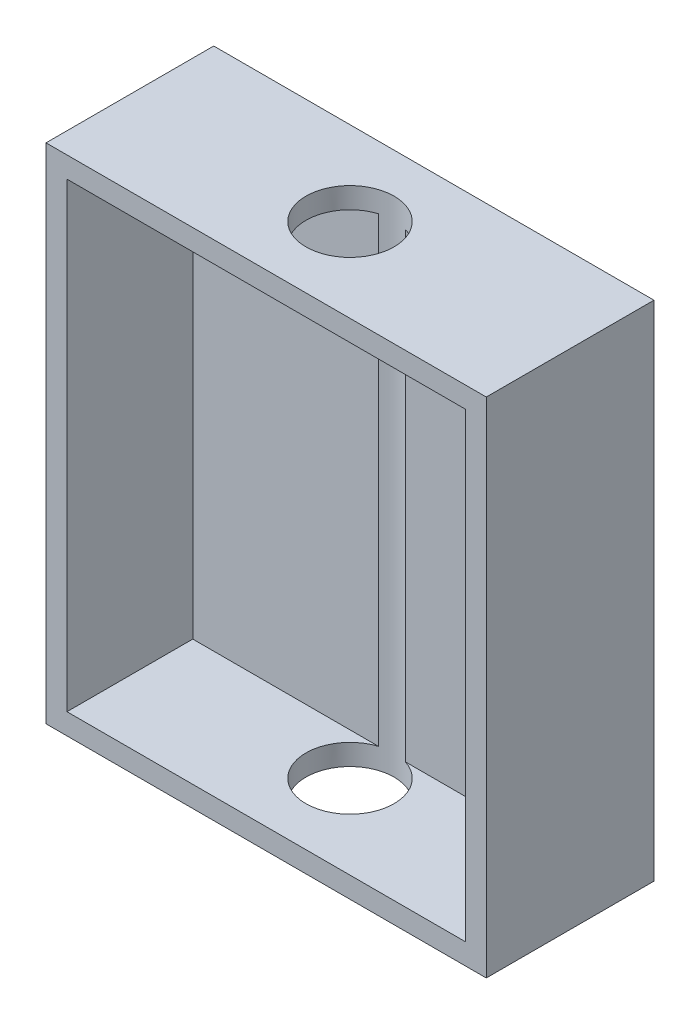
ISO-10303-21;
HEADER;
FILE_DESCRIPTION(('STEP AP214'),'2;1');
FILE_NAME('part.step','',(''),(''),'','','');
FILE_SCHEMA(('AUTOMOTIVE_DESIGN { 1 0 10303 214 1 1 1 1 }'));
ENDSEC;
DATA;
#1=APPLICATION_CONTEXT('core data for automotive mechanical design processes');
#2=APPLICATION_PROTOCOL_DEFINITION('international standard','automotive_design',2000,#1);
#3=PRODUCT_CONTEXT('',#1,'mechanical');
#4=PRODUCT('Part','Part','',(#3));
#5=PRODUCT_RELATED_PRODUCT_CATEGORY('part','',(#4));
#6=PRODUCT_DEFINITION_FORMATION('','',#4);
#7=PRODUCT_DEFINITION_CONTEXT('part definition',#1,'design');
#8=PRODUCT_DEFINITION('design','',#6,#7);
#9=PRODUCT_DEFINITION_SHAPE('','',#8);
#10=(LENGTH_UNIT() NAMED_UNIT(*) SI_UNIT(.MILLI.,.METRE.));
#11=(NAMED_UNIT(*) PLANE_ANGLE_UNIT() SI_UNIT($,.RADIAN.));
#12=(NAMED_UNIT(*) SI_UNIT($,.STERADIAN.) SOLID_ANGLE_UNIT());
#13=UNCERTAINTY_MEASURE_WITH_UNIT(LENGTH_MEASURE(1.E-05),#10,'distance_accuracy_value','');
#14=(GEOMETRIC_REPRESENTATION_CONTEXT(3) GLOBAL_UNCERTAINTY_ASSIGNED_CONTEXT((#13)) GLOBAL_UNIT_ASSIGNED_CONTEXT((#10,
#11,#12)) REPRESENTATION_CONTEXT('',''));
#15=CARTESIAN_POINT('',(0.,0.,0.));
#16=DIRECTION('',(0.,0.,1.));
#17=DIRECTION('',(1.,0.,0.));
#18=AXIS2_PLACEMENT_3D('',#15,#16,#17);
#19=CARTESIAN_POINT('',(0.,0.,2.));
#20=DIRECTION('',(0.,0.,1.));
#21=DIRECTION('',(1.,0.,0.));
#22=AXIS2_PLACEMENT_3D('',#19,#20,#21);
#23=PLANE('',#22);
#24=DIRECTION('',(0.,-1.,0.));
#25=VECTOR('',#24,1.);
#26=CARTESIAN_POINT('',(-0.640312423743285,18.,2.));
#27=LINE('',#26,#25);
#28=CARTESIAN_POINT('',(-0.640312423743285,11.,2.));
#29=VERTEX_POINT('',#28);
#30=CARTESIAN_POINT('',(-0.640312423743285,-11.,2.));
#31=VERTEX_POINT('',#30);
#32=EDGE_CURVE('E11',#29,#31,#27,.T.);
#33=ORIENTED_EDGE('',*,*,#32,.F.);
#34=DIRECTION('',(1.,0.,0.));
#35=VECTOR('',#34,1.);
#36=CARTESIAN_POINT('',(9.5,11.,2.));
#37=LINE('',#36,#35);
#38=CARTESIAN_POINT('',(-9.5,11.,2.));
#39=VERTEX_POINT('',#38);
#40=EDGE_CURVE('E123',#39,#29,#37,.T.);
#41=ORIENTED_EDGE('',*,*,#40,.F.);
#42=DIRECTION('',(0.,1.,0.));
#43=VECTOR('',#42,1.);
#44=CARTESIAN_POINT('',(-9.5,-11.,2.));
#45=LINE('',#44,#43);
#46=CARTESIAN_POINT('',(-9.5,-11.,2.));
#47=VERTEX_POINT('',#46);
#48=EDGE_CURVE('E130',#47,#39,#45,.T.);
#49=ORIENTED_EDGE('',*,*,#48,.F.);
#50=DIRECTION('',(-1.,0.,0.));
#51=VECTOR('',#50,1.);
#52=CARTESIAN_POINT('',(9.5,-11.,2.));
#53=LINE('',#52,#51);
#54=EDGE_CURVE('E136',#31,#47,#53,.T.);
#55=ORIENTED_EDGE('',*,*,#54,.F.);
#56=EDGE_LOOP('',(#33,#41,#49,#55));
#57=FACE_BOUND('',#56,.T.);
#58=ADVANCED_FACE('F36',(#57),#23,.T.);
#59=CARTESIAN_POINT('',(0.,0.,8.));
#60=DIRECTION('',(0.,0.,-1.));
#61=DIRECTION('',(-1.,0.,0.));
#62=AXIS2_PLACEMENT_3D('',#59,#60,#61);
#63=PLANE('',#62);
#64=DIRECTION('',(0.,1.,0.));
#65=VECTOR('',#64,1.);
#66=CARTESIAN_POINT('',(10.5,-12.,8.));
#67=LINE('',#66,#65);
#68=CARTESIAN_POINT('',(10.5,-12.,8.));
#69=VERTEX_POINT('',#68);
#70=CARTESIAN_POINT('',(10.5,12.,8.));
#71=VERTEX_POINT('',#70);
#72=EDGE_CURVE('E158',#69,#71,#67,.T.);
#73=ORIENTED_EDGE('',*,*,#72,.T.);
#74=DIRECTION('',(-1.,0.,0.));
#75=VECTOR('',#74,1.);
#76=CARTESIAN_POINT('',(-10.5,12.,8.));
#77=LINE('',#76,#75);
#78=CARTESIAN_POINT('',(-10.5,12.,8.));
#79=VERTEX_POINT('',#78);
#80=EDGE_CURVE('E161',#71,#79,#77,.T.);
#81=ORIENTED_EDGE('',*,*,#80,.T.);
#82=DIRECTION('',(0.,-1.,0.));
#83=VECTOR('',#82,1.);
#84=CARTESIAN_POINT('',(-10.5,-12.,8.));
#85=LINE('',#84,#83);
#86=CARTESIAN_POINT('',(-10.5,-12.,8.));
#87=VERTEX_POINT('',#86);
#88=EDGE_CURVE('E164',#79,#87,#85,.T.);
#89=ORIENTED_EDGE('',*,*,#88,.T.);
#90=DIRECTION('',(1.,0.,0.));
#91=VECTOR('',#90,1.);
#92=CARTESIAN_POINT('',(-10.5,-12.,8.));
#93=LINE('',#92,#91);
#94=EDGE_CURVE('E166',#87,#69,#93,.T.);
#95=ORIENTED_EDGE('',*,*,#94,.T.);
#96=EDGE_LOOP('',(#73,#81,#89,#95));
#97=FACE_BOUND('',#96,.T.);
#98=DIRECTION('',(0.,1.,0.));
#99=VECTOR('',#98,1.);
#100=CARTESIAN_POINT('',(9.5,-11.,8.));
#101=LINE('',#100,#99);
#102=CARTESIAN_POINT('',(9.5,-11.,8.));
#103=VERTEX_POINT('',#102);
#104=CARTESIAN_POINT('',(9.5,11.,8.));
#105=VERTEX_POINT('',#104);
#106=EDGE_CURVE('E139',#103,#105,#101,.T.);
#107=ORIENTED_EDGE('',*,*,#106,.F.);
#108=DIRECTION('',(1.,0.,0.));
#109=VECTOR('',#108,1.);
#110=CARTESIAN_POINT('',(-9.5,-11.,8.));
#111=LINE('',#110,#109);
#112=CARTESIAN_POINT('',(-9.5,-11.,8.));
#113=VERTEX_POINT('',#112);
#114=EDGE_CURVE('E146',#113,#103,#111,.T.);
#115=ORIENTED_EDGE('',*,*,#114,.F.);
#116=DIRECTION('',(0.,-1.,0.));
#117=VECTOR('',#116,1.);
#118=CARTESIAN_POINT('',(-9.5,-11.,8.));
#119=LINE('',#118,#117);
#120=CARTESIAN_POINT('',(-9.5,11.,8.));
#121=VERTEX_POINT('',#120);
#122=EDGE_CURVE('E143',#121,#113,#119,.T.);
#123=ORIENTED_EDGE('',*,*,#122,.F.);
#124=DIRECTION('',(-1.,0.,0.));
#125=VECTOR('',#124,1.);
#126=CARTESIAN_POINT('',(-9.5,11.,8.));
#127=LINE('',#126,#125);
#128=EDGE_CURVE('E141',#105,#121,#127,.T.);
#129=ORIENTED_EDGE('',*,*,#128,.F.);
#130=EDGE_LOOP('',(#107,#115,#123,#129));
#131=FACE_BOUND('',#130,.T.);
#132=ADVANCED_FACE('F205',(#97,#131),#63,.F.);
#133=CARTESIAN_POINT('',(0.,0.,0.));
#134=DIRECTION('',(0.,0.,-1.));
#135=DIRECTION('',(-1.,0.,0.));
#136=AXIS2_PLACEMENT_3D('',#133,#134,#135);
#137=PLANE('',#136);
#138=DIRECTION('',(0.,1.,0.));
#139=VECTOR('',#138,1.);
#140=CARTESIAN_POINT('',(10.5,-12.,0.));
#141=LINE('',#140,#139);
#142=CARTESIAN_POINT('',(10.5,-12.,0.));
#143=VERTEX_POINT('',#142);
#144=CARTESIAN_POINT('',(10.5,12.,0.));
#145=VERTEX_POINT('',#144);
#146=EDGE_CURVE('E157',#143,#145,#141,.T.);
#147=ORIENTED_EDGE('',*,*,#146,.F.);
#148=DIRECTION('',(1.,0.,0.));
#149=VECTOR('',#148,1.);
#150=CARTESIAN_POINT('',(-10.5,-12.,0.));
#151=LINE('',#150,#149);
#152=CARTESIAN_POINT('',(-10.5,-12.,0.));
#153=VERTEX_POINT('',#152);
#154=EDGE_CURVE('E162',#153,#143,#151,.T.);
#155=ORIENTED_EDGE('',*,*,#154,.F.);
#156=DIRECTION('',(0.,-1.,0.));
#157=VECTOR('',#156,1.);
#158=CARTESIAN_POINT('',(-10.5,-12.,0.));
#159=LINE('',#158,#157);
#160=CARTESIAN_POINT('',(-10.5,12.,0.));
#161=VERTEX_POINT('',#160);
#162=EDGE_CURVE('E173',#161,#153,#159,.T.);
#163=ORIENTED_EDGE('',*,*,#162,.F.);
#164=DIRECTION('',(-1.,0.,0.));
#165=VECTOR('',#164,1.);
#166=CARTESIAN_POINT('',(-10.5,12.,0.));
#167=LINE('',#166,#165);
#168=EDGE_CURVE('E171',#145,#161,#167,.T.);
#169=ORIENTED_EDGE('',*,*,#168,.F.);
#170=EDGE_LOOP('',(#147,#155,#163,#169));
#171=FACE_BOUND('',#170,.T.);
#172=ADVANCED_FACE('F195',(#171),#137,.T.);
#173=CARTESIAN_POINT('',(10.5,-12.,8.));
#174=DIRECTION('',(-1.,0.,0.));
#175=DIRECTION('',(0.,0.,1.));
#176=AXIS2_PLACEMENT_3D('',#173,#174,#175);
#177=PLANE('',#176);
#178=ORIENTED_EDGE('',*,*,#146,.T.);
#179=DIRECTION('',(0.,0.,-1.));
#180=VECTOR('',#179,1.);
#181=CARTESIAN_POINT('',(10.5,12.,8.));
#182=LINE('',#181,#180);
#183=EDGE_CURVE('E118',#71,#145,#182,.T.);
#184=ORIENTED_EDGE('',*,*,#183,.F.);
#185=ORIENTED_EDGE('',*,*,#72,.F.);
#186=DIRECTION('',(0.,0.,-1.));
#187=VECTOR('',#186,1.);
#188=CARTESIAN_POINT('',(10.5,-12.,8.));
#189=LINE('',#188,#187);
#190=EDGE_CURVE('E168',#69,#143,#189,.T.);
#191=ORIENTED_EDGE('',*,*,#190,.T.);
#192=EDGE_LOOP('',(#178,#184,#185,#191));
#193=FACE_BOUND('',#192,.T.);
#194=ADVANCED_FACE('F38',(#193),#177,.F.);
#195=CARTESIAN_POINT('',(-10.5,12.,8.));
#196=DIRECTION('',(0.,-1.,0.));
#197=DIRECTION('',(0.,0.,-1.));
#198=AXIS2_PLACEMENT_3D('',#195,#196,#197);
#199=PLANE('',#198);
#200=CARTESIAN_POINT('',(0.,12.,4.));
#201=DIRECTION('',(0.,-1.,0.));
#202=DIRECTION('',(0.,0.,-1.));
#203=AXIS2_PLACEMENT_3D('',#200,#201,#202);
#204=CIRCLE('',#203,2.1);
#205=CARTESIAN_POINT('',(0.,12.,1.9));
#206=VERTEX_POINT('',#205);
#207=EDGE_CURVE('E124',#206,#206,#204,.T.);
#208=ORIENTED_EDGE('',*,*,#207,.T.);
#209=EDGE_LOOP('',(#208));
#210=FACE_BOUND('',#209,.T.);
#211=ORIENTED_EDGE('',*,*,#168,.T.);
#212=DIRECTION('',(0.,0.,-1.));
#213=VECTOR('',#212,1.);
#214=CARTESIAN_POINT('',(-10.5,12.,8.));
#215=LINE('',#214,#213);
#216=EDGE_CURVE('E181',#79,#161,#215,.T.);
#217=ORIENTED_EDGE('',*,*,#216,.F.);
#218=ORIENTED_EDGE('',*,*,#80,.F.);
#219=ORIENTED_EDGE('',*,*,#183,.T.);
#220=EDGE_LOOP('',(#211,#217,#218,#219));
#221=FACE_BOUND('',#220,.T.);
#222=ADVANCED_FACE('F187',(#210,#221),#199,.F.);
#223=CARTESIAN_POINT('',(-10.5,-12.,8.));
#224=DIRECTION('',(1.,0.,0.));
#225=DIRECTION('',(0.,0.,-1.));
#226=AXIS2_PLACEMENT_3D('',#223,#224,#225);
#227=PLANE('',#226);
#228=ORIENTED_EDGE('',*,*,#162,.T.);
#229=DIRECTION('',(0.,0.,-1.));
#230=VECTOR('',#229,1.);
#231=CARTESIAN_POINT('',(-10.5,-12.,8.));
#232=LINE('',#231,#230);
#233=EDGE_CURVE('E178',#87,#153,#232,.T.);
#234=ORIENTED_EDGE('',*,*,#233,.F.);
#235=ORIENTED_EDGE('',*,*,#88,.F.);
#236=ORIENTED_EDGE('',*,*,#216,.T.);
#237=EDGE_LOOP('',(#228,#234,#235,#236));
#238=FACE_BOUND('',#237,.T.);
#239=ADVANCED_FACE('F199',(#238),#227,.F.);
#240=CARTESIAN_POINT('',(-10.5,-12.,8.));
#241=DIRECTION('',(0.,1.,0.));
#242=DIRECTION('',(0.,0.,1.));
#243=AXIS2_PLACEMENT_3D('',#240,#241,#242);
#244=PLANE('',#243);
#245=CARTESIAN_POINT('',(0.,-12.,4.));
#246=DIRECTION('',(0.,-1.,0.));
#247=DIRECTION('',(0.,0.,-1.));
#248=AXIS2_PLACEMENT_3D('',#245,#246,#247);
#249=CIRCLE('',#248,2.1);
#250=CARTESIAN_POINT('',(0.,-12.,1.9));
#251=VERTEX_POINT('',#250);
#252=EDGE_CURVE('E224',#251,#251,#249,.T.);
#253=ORIENTED_EDGE('',*,*,#252,.F.);
#254=EDGE_LOOP('',(#253));
#255=FACE_BOUND('',#254,.T.);
#256=ORIENTED_EDGE('',*,*,#154,.T.);
#257=ORIENTED_EDGE('',*,*,#190,.F.);
#258=ORIENTED_EDGE('',*,*,#94,.F.);
#259=ORIENTED_EDGE('',*,*,#233,.T.);
#260=EDGE_LOOP('',(#256,#257,#258,#259));
#261=FACE_BOUND('',#260,.T.);
#262=ADVANCED_FACE('F203',(#255,#261),#244,.F.);
#263=CARTESIAN_POINT('',(9.5,-11.,8.));
#264=DIRECTION('',(-1.,0.,0.));
#265=DIRECTION('',(0.,0.,1.));
#266=AXIS2_PLACEMENT_3D('',#263,#264,#265);
#267=PLANE('',#266);
#268=DIRECTION('',(0.,-1.,0.));
#269=VECTOR('',#268,1.);
#270=CARTESIAN_POINT('',(9.5,-11.,2.));
#271=LINE('',#270,#269);
#272=CARTESIAN_POINT('',(9.5,11.,2.));
#273=VERTEX_POINT('',#272);
#274=CARTESIAN_POINT('',(9.5,-11.,2.));
#275=VERTEX_POINT('',#274);
#276=EDGE_CURVE('E129',#273,#275,#271,.T.);
#277=ORIENTED_EDGE('',*,*,#276,.T.);
#278=DIRECTION('',(0.,0.,-1.));
#279=VECTOR('',#278,1.);
#280=CARTESIAN_POINT('',(9.5,-11.,8.));
#281=LINE('',#280,#279);
#282=EDGE_CURVE('E148',#103,#275,#281,.T.);
#283=ORIENTED_EDGE('',*,*,#282,.F.);
#284=ORIENTED_EDGE('',*,*,#106,.T.);
#285=DIRECTION('',(0.,0.,-1.));
#286=VECTOR('',#285,1.);
#287=CARTESIAN_POINT('',(9.5,11.,8.));
#288=LINE('',#287,#286);
#289=EDGE_CURVE('E155',#105,#273,#288,.T.);
#290=ORIENTED_EDGE('',*,*,#289,.T.);
#291=EDGE_LOOP('',(#277,#283,#284,#290));
#292=FACE_BOUND('',#291,.T.);
#293=ADVANCED_FACE('F215',(#292),#267,.T.);
#294=CARTESIAN_POINT('',(-9.5,11.,8.));
#295=DIRECTION('',(0.,-1.,0.));
#296=DIRECTION('',(0.,0.,-1.));
#297=AXIS2_PLACEMENT_3D('',#294,#295,#296);
#298=PLANE('',#297);
#299=CARTESIAN_POINT('',(0.,11.,4.));
#300=DIRECTION('',(0.,-1.,0.));
#301=DIRECTION('',(0.,0.,-1.));
#302=AXIS2_PLACEMENT_3D('',#299,#300,#301);
#303=CIRCLE('',#302,2.1);
#304=CARTESIAN_POINT('',(0.640312423743286,11.,2.));
#305=VERTEX_POINT('',#304);
#306=EDGE_CURVE('E113',#305,#29,#303,.T.);
#307=ORIENTED_EDGE('',*,*,#306,.F.);
#308=EDGE_CURVE('E58',#305,#273,#37,.T.);
#309=ORIENTED_EDGE('',*,*,#308,.T.);
#310=ORIENTED_EDGE('',*,*,#289,.F.);
#311=ORIENTED_EDGE('',*,*,#128,.T.);
#312=DIRECTION('',(0.,0.,-1.));
#313=VECTOR('',#312,1.);
#314=CARTESIAN_POINT('',(-9.5,11.,8.));
#315=LINE('',#314,#313);
#316=EDGE_CURVE('E153',#121,#39,#315,.T.);
#317=ORIENTED_EDGE('',*,*,#316,.T.);
#318=ORIENTED_EDGE('',*,*,#40,.T.);
#319=EDGE_LOOP('',(#307,#309,#310,#311,#317,#318));
#320=FACE_BOUND('',#319,.T.);
#321=ADVANCED_FACE('F120',(#320),#298,.T.);
#322=CARTESIAN_POINT('',(-9.5,-11.,8.));
#323=DIRECTION('',(1.,0.,0.));
#324=DIRECTION('',(0.,0.,-1.));
#325=AXIS2_PLACEMENT_3D('',#322,#323,#324);
#326=PLANE('',#325);
#327=ORIENTED_EDGE('',*,*,#48,.T.);
#328=ORIENTED_EDGE('',*,*,#316,.F.);
#329=ORIENTED_EDGE('',*,*,#122,.T.);
#330=DIRECTION('',(0.,0.,-1.));
#331=VECTOR('',#330,1.);
#332=CARTESIAN_POINT('',(-9.5,-11.,8.));
#333=LINE('',#332,#331);
#334=EDGE_CURVE('E150',#113,#47,#333,.T.);
#335=ORIENTED_EDGE('',*,*,#334,.T.);
#336=EDGE_LOOP('',(#327,#328,#329,#335));
#337=FACE_BOUND('',#336,.T.);
#338=ADVANCED_FACE('F218',(#337),#326,.T.);
#339=CARTESIAN_POINT('',(-9.5,-11.,8.));
#340=DIRECTION('',(0.,1.,0.));
#341=DIRECTION('',(0.,0.,1.));
#342=AXIS2_PLACEMENT_3D('',#339,#340,#341);
#343=PLANE('',#342);
#344=CARTESIAN_POINT('',(0.,-11.,4.));
#345=DIRECTION('',(0.,1.,0.));
#346=DIRECTION('',(0.,0.,1.));
#347=AXIS2_PLACEMENT_3D('',#344,#345,#346);
#348=CIRCLE('',#347,2.1);
#349=CARTESIAN_POINT('',(0.640312423743286,-11.,2.));
#350=VERTEX_POINT('',#349);
#351=EDGE_CURVE('E50',#31,#350,#348,.T.);
#352=ORIENTED_EDGE('',*,*,#351,.F.);
#353=ORIENTED_EDGE('',*,*,#54,.T.);
#354=ORIENTED_EDGE('',*,*,#334,.F.);
#355=ORIENTED_EDGE('',*,*,#114,.T.);
#356=ORIENTED_EDGE('',*,*,#282,.T.);
#357=EDGE_CURVE('E137',#275,#350,#53,.T.);
#358=ORIENTED_EDGE('',*,*,#357,.T.);
#359=EDGE_LOOP('',(#352,#353,#354,#355,#356,#358));
#360=FACE_BOUND('',#359,.T.);
#361=ADVANCED_FACE('F223',(#360),#343,.T.);
#362=DIRECTION('',(0.,-1.,0.));
#363=VECTOR('',#362,1.);
#364=CARTESIAN_POINT('',(0.640312423743286,18.,2.));
#365=LINE('',#364,#363);
#366=EDGE_CURVE('E44',#350,#305,#365,.F.);
#367=ORIENTED_EDGE('',*,*,#366,.F.);
#368=ORIENTED_EDGE('',*,*,#357,.F.);
#369=ORIENTED_EDGE('',*,*,#276,.F.);
#370=ORIENTED_EDGE('',*,*,#308,.F.);
#371=EDGE_LOOP('',(#367,#368,#369,#370));
#372=FACE_BOUND('',#371,.T.);
#373=ADVANCED_FACE('F127',(#372),#23,.T.);
#374=CARTESIAN_POINT('',(0.,18.,4.));
#375=DIRECTION('',(0.,-1.,0.));
#376=DIRECTION('',(0.,0.,-1.));
#377=AXIS2_PLACEMENT_3D('',#374,#375,#376);
#378=CYLINDRICAL_SURFACE('',#377,2.1);
#379=ORIENTED_EDGE('',*,*,#252,.T.);
#380=EDGE_LOOP('',(#379));
#381=FACE_BOUND('',#380,.T.);
#382=ORIENTED_EDGE('',*,*,#32,.T.);
#383=ORIENTED_EDGE('',*,*,#351,.T.);
#384=ORIENTED_EDGE('',*,*,#366,.T.);
#385=ORIENTED_EDGE('',*,*,#306,.T.);
#386=EDGE_LOOP('',(#382,#383,#384,#385));
#387=FACE_BOUND('',#386,.T.);
#388=ORIENTED_EDGE('',*,*,#207,.F.);
#389=EDGE_LOOP('',(#388));
#390=FACE_BOUND('',#389,.T.);
#391=ADVANCED_FACE('F111',(#381,#387,#390),#378,.F.);
#392=CLOSED_SHELL('',(#58,#132,#172,#194,#222,#239,#262,#293,#321,#338,#361,#373,#391));
#393=MANIFOLD_SOLID_BREP('B2',#392);
#394=ADVANCED_BREP_SHAPE_REPRESENTATION('',(#18,#393),#14);
#395=SHAPE_DEFINITION_REPRESENTATION(#9,#394);
ENDSEC;
END-ISO-10303-21;
